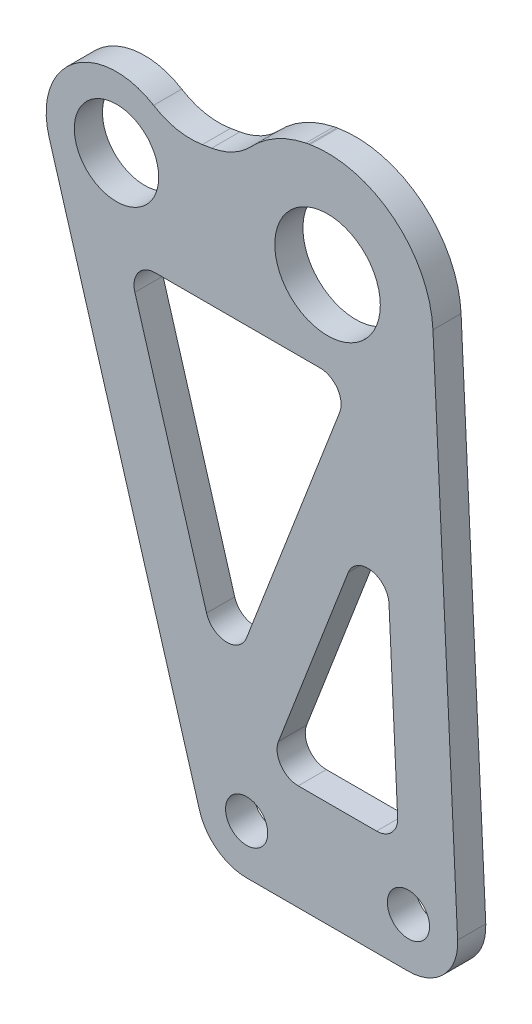
ISO-10303-21;
HEADER;
FILE_DESCRIPTION(('STEP AP214'),'2;1');
FILE_NAME('part.step','',(''),(''),'','','');
FILE_SCHEMA(('AUTOMOTIVE_DESIGN { 1 0 10303 214 1 1 1 1 }'));
ENDSEC;
DATA;
#1=APPLICATION_CONTEXT('core data for automotive mechanical design processes');
#2=APPLICATION_PROTOCOL_DEFINITION('international standard','automotive_design',2000,#1);
#3=PRODUCT_CONTEXT('',#1,'mechanical');
#4=PRODUCT('Part','Part','',(#3));
#5=PRODUCT_RELATED_PRODUCT_CATEGORY('part','',(#4));
#6=PRODUCT_DEFINITION_FORMATION('','',#4);
#7=PRODUCT_DEFINITION_CONTEXT('part definition',#1,'design');
#8=PRODUCT_DEFINITION('design','',#6,#7);
#9=PRODUCT_DEFINITION_SHAPE('','',#8);
#10=(LENGTH_UNIT() NAMED_UNIT(*) SI_UNIT(.MILLI.,.METRE.));
#11=(NAMED_UNIT(*) PLANE_ANGLE_UNIT() SI_UNIT($,.RADIAN.));
#12=(NAMED_UNIT(*) SI_UNIT($,.STERADIAN.) SOLID_ANGLE_UNIT());
#13=UNCERTAINTY_MEASURE_WITH_UNIT(LENGTH_MEASURE(1.E-05),#10,'distance_accuracy_value','');
#14=(GEOMETRIC_REPRESENTATION_CONTEXT(3) GLOBAL_UNCERTAINTY_ASSIGNED_CONTEXT((#13)) GLOBAL_UNIT_ASSIGNED_CONTEXT((#10,
#11,#12)) REPRESENTATION_CONTEXT('',''));
#15=CARTESIAN_POINT('',(0.,0.,0.));
#16=DIRECTION('',(0.,0.,1.));
#17=DIRECTION('',(1.,0.,0.));
#18=AXIS2_PLACEMENT_3D('',#15,#16,#17);
#19=CARTESIAN_POINT('',(-11.5,0.,4.));
#20=DIRECTION('',(0.,0.,1.));
#21=DIRECTION('',(1.,0.,0.));
#22=AXIS2_PLACEMENT_3D('',#19,#20,#21);
#23=PLANE('',#22);
#24=DIRECTION('',(-0.986013297183269,-0.166666666666668,0.));
#25=VECTOR('',#24,1.);
#26=CARTESIAN_POINT('',(-31.6666666666667,82.8601329718327,4.));
#27=LINE('',#26,#25);
#28=CARTESIAN_POINT('',(-2.50000000000001,87.790199457749,4.));
#29=VERTEX_POINT('',#28);
#30=CARTESIAN_POINT('',(-2.69219041403478,87.7577133485212,4.));
#31=VERTEX_POINT('',#30);
#32=EDGE_CURVE('E358',#29,#31,#27,.T.);
#33=ORIENTED_EDGE('',*,*,#32,.T.);
#34=CARTESIAN_POINT('',(-1.02552374736811,77.8975803766885,4.));
#35=DIRECTION('',(0.,0.,1.));
#36=DIRECTION('',(1.,0.,0.));
#37=AXIS2_PLACEMENT_3D('',#34,#35,#36);
#38=CIRCLE('',#37,10.);
#39=CARTESIAN_POINT('',(-3.07501452764109,87.6853067491192,4.));
#40=VERTEX_POINT('',#39);
#41=EDGE_CURVE('E332',#31,#40,#38,.T.);
#42=ORIENTED_EDGE('',*,*,#41,.T.);
#43=CARTESIAN_POINT('',(0.,73.,4.));
#44=DIRECTION('',(0.,0.,-1.));
#45=DIRECTION('',(1.,0.,0.));
#46=AXIS2_PLACEMENT_3D('',#43,#44,#45);
#47=CIRCLE('',#46,15.0037978079195);
#48=CARTESIAN_POINT('',(-10.8789653453183,83.3325728488258,4.));
#49=VERTEX_POINT('',#48);
#50=EDGE_CURVE('E370',#49,#40,#47,.T.);
#51=ORIENTED_EDGE('',*,*,#50,.F.);
#52=CARTESIAN_POINT('',(-18.1297730971903,90.2192111394138,4.));
#53=DIRECTION('',(0.,0.,1.));
#54=DIRECTION('',(1.,0.,0.));
#55=AXIS2_PLACEMENT_3D('',#52,#53,#54);
#56=CIRCLE('',#55,10.);
#57=CARTESIAN_POINT('',(-16.4631064305237,80.3590781675811,4.));
#58=VERTEX_POINT('',#57);
#59=EDGE_CURVE('E346',#49,#58,#56,.F.);
#60=ORIENTED_EDGE('',*,*,#59,.T.);
#61=DIRECTION('',(0.986013297183269,0.166666666666667,0.));
#62=VECTOR('',#61,1.);
#63=CARTESIAN_POINT('',(-22.2942076950337,79.3734421588904,4.));
#64=LINE('',#63,#62);
#65=CARTESIAN_POINT('',(-17.7896034645846,80.1348592451368,4.));
#66=VERTEX_POINT('',#65);
#67=EDGE_CURVE('E352',#66,#58,#64,.T.);
#68=ORIENTED_EDGE('',*,*,#67,.F.);
#69=CARTESIAN_POINT('',(-19.4562701312513,89.9949922169695,4.));
#70=DIRECTION('',(0.,0.,1.));
#71=DIRECTION('',(1.,0.,0.));
#72=AXIS2_PLACEMENT_3D('',#69,#70,#71);
#73=CIRCLE('',#72,10.);
#74=CARTESIAN_POINT('',(-24.7281350656256,81.4974961084848,4.));
#75=VERTEX_POINT('',#74);
#76=EDGE_CURVE('E63',#66,#75,#73,.F.);
#77=ORIENTED_EDGE('',*,*,#76,.T.);
#78=CARTESIAN_POINT('',(-30.,73.,4.));
#79=DIRECTION('',(0.,0.,1.));
#80=DIRECTION('',(1.,0.,0.));
#81=AXIS2_PLACEMENT_3D('',#78,#79,#80);
#82=CIRCLE('',#81,10.);
#83=CARTESIAN_POINT('',(-39.5880069117665,70.15920372784,4.));
#84=VERTEX_POINT('',#83);
#85=EDGE_CURVE('E350',#75,#84,#82,.T.);
#86=ORIENTED_EDGE('',*,*,#85,.T.);
#87=DIRECTION('',(0.284079627216,-0.958800691176648,0.));
#88=VECTOR('',#87,1.);
#89=CARTESIAN_POINT('',(-39.5880069117665,70.15920372784,4.));
#90=LINE('',#89,#88);
#91=CARTESIAN_POINT('',(-18.2116048382365,-1.988557390512,4.));
#92=VERTEX_POINT('',#91);
#93=EDGE_CURVE('E241',#84,#92,#90,.T.);
#94=ORIENTED_EDGE('',*,*,#93,.T.);
#95=CARTESIAN_POINT('',(-11.5,0.,4.));
#96=DIRECTION('',(0.,0.,1.));
#97=DIRECTION('',(1.,0.,0.));
#98=AXIS2_PLACEMENT_3D('',#95,#96,#97);
#99=CIRCLE('',#98,7.);
#100=CARTESIAN_POINT('',(-11.5,-7.,4.));
#101=VERTEX_POINT('',#100);
#102=EDGE_CURVE('E235',#92,#101,#99,.T.);
#103=ORIENTED_EDGE('',*,*,#102,.T.);
#104=DIRECTION('',(1.,0.,0.));
#105=VECTOR('',#104,1.);
#106=CARTESIAN_POINT('',(-11.5,-7.,4.));
#107=LINE('',#106,#105);
#108=CARTESIAN_POINT('',(11.5,-7.,4.));
#109=VERTEX_POINT('',#108);
#110=EDGE_CURVE('E224',#101,#109,#107,.T.);
#111=ORIENTED_EDGE('',*,*,#110,.T.);
#112=CARTESIAN_POINT('',(11.5,0.,4.));
#113=DIRECTION('',(0.,0.,1.));
#114=DIRECTION('',(1.,0.,0.));
#115=AXIS2_PLACEMENT_3D('',#112,#113,#114);
#116=CIRCLE('',#115,7.);
#117=CARTESIAN_POINT('',(18.4920100753608,0.334357751597923,4.));
#118=VERTEX_POINT('',#117);
#119=EDGE_CURVE('E234',#109,#118,#116,.T.);
#120=ORIENTED_EDGE('',*,*,#119,.T.);
#121=DIRECTION('',(-0.0477653930854182,0.998858582194394,0.));
#122=VECTOR('',#121,1.);
#123=CARTESIAN_POINT('',(14.9828787329159,73.7164808962813,4.));
#124=LINE('',#123,#122);
#125=CARTESIAN_POINT('',(14.9828787329159,73.7164808962813,4.));
#126=VERTEX_POINT('',#125);
#127=EDGE_CURVE('E410',#118,#126,#124,.T.);
#128=ORIENTED_EDGE('',*,*,#127,.T.);
#129=CARTESIAN_POINT('',(0.,73.,4.));
#130=DIRECTION('',(0.,0.,1.));
#131=DIRECTION('',(1.,0.,0.));
#132=AXIS2_PLACEMENT_3D('',#129,#130,#131);
#133=CIRCLE('',#132,15.);
#134=EDGE_CURVE('E412',#126,#29,#133,.T.);
#135=ORIENTED_EDGE('',*,*,#134,.T.);
#136=EDGE_LOOP('',(#33,#42,#51,#60,#68,#77,#86,#94,#103,#111,#120,#128,#135));
#137=FACE_BOUND('',#136,.T.);
#138=CARTESIAN_POINT('',(0.,73.,4.));
#139=DIRECTION('',(0.,0.,1.));
#140=DIRECTION('',(1.,0.,0.));
#141=AXIS2_PLACEMENT_3D('',#138,#139,#140);
#142=CIRCLE('',#141,7.5);
#143=CARTESIAN_POINT('',(7.5,73.,4.));
#144=VERTEX_POINT('',#143);
#145=EDGE_CURVE('E392',#144,#144,#142,.T.);
#146=ORIENTED_EDGE('',*,*,#145,.F.);
#147=EDGE_LOOP('',(#146));
#148=FACE_BOUND('',#147,.T.);
#149=CARTESIAN_POINT('',(-11.5,0.,4.));
#150=DIRECTION('',(0.,0.,1.));
#151=DIRECTION('',(1.,0.,0.));
#152=AXIS2_PLACEMENT_3D('',#149,#150,#151);
#153=CIRCLE('',#152,3.);
#154=CARTESIAN_POINT('',(-8.5,0.,4.));
#155=VERTEX_POINT('',#154);
#156=EDGE_CURVE('E404',#155,#155,#153,.T.);
#157=ORIENTED_EDGE('',*,*,#156,.F.);
#158=EDGE_LOOP('',(#157));
#159=FACE_BOUND('',#158,.T.);
#160=CARTESIAN_POINT('',(11.5,0.,4.));
#161=DIRECTION('',(0.,0.,1.));
#162=DIRECTION('',(1.,0.,0.));
#163=AXIS2_PLACEMENT_3D('',#160,#161,#162);
#164=CIRCLE('',#163,3.);
#165=CARTESIAN_POINT('',(14.5,0.,4.));
#166=VERTEX_POINT('',#165);
#167=EDGE_CURVE('E398',#166,#166,#164,.T.);
#168=ORIENTED_EDGE('',*,*,#167,.F.);
#169=EDGE_LOOP('',(#168));
#170=FACE_BOUND('',#169,.T.);
#171=CARTESIAN_POINT('',(-30.,73.,4.));
#172=DIRECTION('',(0.,0.,1.));
#173=DIRECTION('',(1.,0.,0.));
#174=AXIS2_PLACEMENT_3D('',#171,#172,#173);
#175=CIRCLE('',#174,6.);
#176=CARTESIAN_POINT('',(-24.,73.,4.));
#177=VERTEX_POINT('',#176);
#178=EDGE_CURVE('E385',#177,#177,#175,.T.);
#179=ORIENTED_EDGE('',*,*,#178,.F.);
#180=EDGE_LOOP('',(#179));
#181=FACE_BOUND('',#180,.T.);
#182=DIRECTION('',(-0.284079627216,0.958800691176648,0.));
#183=VECTOR('',#182,1.);
#184=CARTESIAN_POINT('',(-9.61313511093276,-2.84824141640891,4.));
#185=LINE('',#184,#183);
#186=CARTESIAN_POINT('',(-17.1971796266505,22.7487617719107,4.));
#187=VERTEX_POINT('',#186);
#188=CARTESIAN_POINT('',(-27.3891360998442,57.147761118352,4.));
#189=VERTEX_POINT('',#188);
#190=EDGE_CURVE('E777',#187,#189,#185,.T.);
#191=ORIENTED_EDGE('',*,*,#190,.T.);
#192=CARTESIAN_POINT('',(-24.5127340263143,58.,4.));
#193=DIRECTION('',(0.,0.,1.));
#194=DIRECTION('',(1.,0.,0.));
#195=AXIS2_PLACEMENT_3D('',#192,#193,#194);
#196=CIRCLE('',#195,3.);
#197=CARTESIAN_POINT('',(-24.5127340263143,61.,4.));
#198=VERTEX_POINT('',#197);
#199=EDGE_CURVE('E317',#189,#198,#196,.F.);
#200=ORIENTED_EDGE('',*,*,#199,.T.);
#201=DIRECTION('',(1.,0.,0.));
#202=VECTOR('',#201,1.);
#203=CARTESIAN_POINT('',(0.,61.,4.));
#204=LINE('',#203,#202);
#205=CARTESIAN_POINT('',(-1.07446247065,61.,4.));
#206=VERTEX_POINT('',#205);
#207=EDGE_CURVE('E774',#198,#206,#204,.T.);
#208=ORIENTED_EDGE('',*,*,#207,.T.);
#209=CARTESIAN_POINT('',(-1.07446247065,58.,4.));
#210=DIRECTION('',(0.,0.,1.));
#211=DIRECTION('',(1.,0.,0.));
#212=AXIS2_PLACEMENT_3D('',#209,#210,#211);
#213=CIRCLE('',#212,3.);
#214=CARTESIAN_POINT('',(1.72513971247356,56.9219333896972,4.));
#215=VERTEX_POINT('',#214);
#216=EDGE_CURVE('E321',#206,#215,#213,.F.);
#217=ORIENTED_EDGE('',*,*,#216,.T.);
#218=DIRECTION('',(-0.359355536767607,-0.933200727707852,0.));
#219=VECTOR('',#218,1.);
#220=CARTESIAN_POINT('',(-17.5864572783995,6.77216659554331,4.));
#221=LINE('',#220,#219);
#222=CARTESIAN_POINT('',(-11.5211753699969,22.5229340432559,4.));
#223=VERTEX_POINT('',#222);
#224=EDGE_CURVE('E768',#215,#223,#221,.T.);
#225=ORIENTED_EDGE('',*,*,#224,.T.);
#226=CARTESIAN_POINT('',(-14.3207775531205,23.6010006535587,4.));
#227=DIRECTION('',(0.,0.,1.));
#228=DIRECTION('',(1.,0.,0.));
#229=AXIS2_PLACEMENT_3D('',#226,#227,#228);
#230=CIRCLE('',#229,3.);
#231=EDGE_CURVE('E313',#223,#187,#230,.F.);
#232=ORIENTED_EDGE('',*,*,#231,.T.);
#233=EDGE_LOOP('',(#191,#200,#208,#217,#225,#232));
#234=FACE_BOUND('',#233,.T.);
#235=DIRECTION('',(-0.359355536767607,-0.933200727707852,0.));
#236=VECTOR('',#235,1.);
#237=CARTESIAN_POINT('',(-10.1208514567366,3.89732230140245,4.));
#238=LINE('',#237,#236);
#239=CARTESIAN_POINT('',(2.93918358285541,37.8125760149386,4.));
#240=VERTEX_POINT('',#239);
#241=CARTESIAN_POINT('',(-6.97062270637526,12.0780666103028,4.));
#242=VERTEX_POINT('',#241);
#243=EDGE_CURVE('E765',#240,#242,#238,.T.);
#244=ORIENTED_EDGE('',*,*,#243,.F.);
#245=CARTESIAN_POINT('',(5.73878576597896,36.7345094046358,4.));
#246=DIRECTION('',(0.,0.,1.));
#247=DIRECTION('',(1.,0.,0.));
#248=AXIS2_PLACEMENT_3D('',#245,#246,#247);
#249=CIRCLE('',#248,3.);
#250=CARTESIAN_POINT('',(8.73536151256215,36.877805583892,4.));
#251=VERTEX_POINT('',#250);
#252=EDGE_CURVE('E309',#240,#251,#249,.F.);
#253=ORIENTED_EDGE('',*,*,#252,.T.);
#254=DIRECTION('',(0.0477653930854184,-0.998858582194394,0.));
#255=VECTOR('',#254,1.);
#256=CARTESIAN_POINT('',(10.4749037908747,0.50090964429006,4.));
#257=LINE('',#256,#255);
#258=CARTESIAN_POINT('',(9.96598512583916,11.1432961792563,4.));
#259=VERTEX_POINT('',#258);
#260=EDGE_CURVE('E761',#251,#259,#257,.T.);
#261=ORIENTED_EDGE('',*,*,#260,.T.);
#262=CARTESIAN_POINT('',(6.96940937925598,11.,4.));
#263=DIRECTION('',(0.,0.,1.));
#264=DIRECTION('',(1.,0.,0.));
#265=AXIS2_PLACEMENT_3D('',#262,#263,#264);
#266=CIRCLE('',#265,3.);
#267=CARTESIAN_POINT('',(6.96940937925598,8.,4.));
#268=VERTEX_POINT('',#267);
#269=EDGE_CURVE('E305',#259,#268,#266,.F.);
#270=ORIENTED_EDGE('',*,*,#269,.T.);
#271=DIRECTION('',(-1.,0.,0.));
#272=VECTOR('',#271,1.);
#273=CARTESIAN_POINT('',(0.,8.,4.));
#274=LINE('',#273,#272);
#275=CARTESIAN_POINT('',(-4.17102052325171,8.,4.));
#276=VERTEX_POINT('',#275);
#277=EDGE_CURVE('E755',#268,#276,#274,.T.);
#278=ORIENTED_EDGE('',*,*,#277,.T.);
#279=CARTESIAN_POINT('',(-4.17102052325171,11.,4.));
#280=DIRECTION('',(0.,0.,1.));
#281=DIRECTION('',(1.,0.,0.));
#282=AXIS2_PLACEMENT_3D('',#279,#280,#281);
#283=CIRCLE('',#282,3.);
#284=EDGE_CURVE('E325',#276,#242,#283,.F.);
#285=ORIENTED_EDGE('',*,*,#284,.T.);
#286=EDGE_LOOP('',(#244,#253,#261,#270,#278,#285));
#287=FACE_BOUND('',#286,.T.);
#288=ADVANCED_FACE('F55',(#137,#148,#159,#170,#181,#234,#287),#23,.T.);
#289=CARTESIAN_POINT('',(-11.5,0.,0.));
#290=DIRECTION('',(0.,0.,1.));
#291=DIRECTION('',(1.,0.,0.));
#292=AXIS2_PLACEMENT_3D('',#289,#290,#291);
#293=PLANE('',#292);
#294=DIRECTION('',(-0.359355536767607,-0.933200727707852,0.));
#295=VECTOR('',#294,1.);
#296=CARTESIAN_POINT('',(-19.0715258991631,2.91563183874348,0.));
#297=LINE('',#296,#295);
#298=CARTESIAN_POINT('',(1.72513971247356,56.9219333896972,0.));
#299=VERTEX_POINT('',#298);
#300=CARTESIAN_POINT('',(-11.521175369997,22.5229340432558,0.));
#301=VERTEX_POINT('',#300);
#302=EDGE_CURVE('E263',#299,#301,#297,.T.);
#303=ORIENTED_EDGE('',*,*,#302,.F.);
#304=CARTESIAN_POINT('',(-1.07446247065,58.,0.));
#305=DIRECTION('',(0.,0.,1.));
#306=DIRECTION('',(1.,0.,0.));
#307=AXIS2_PLACEMENT_3D('',#304,#305,#306);
#308=CIRCLE('',#307,3.);
#309=CARTESIAN_POINT('',(-1.07446247065,61.,0.));
#310=VERTEX_POINT('',#309);
#311=EDGE_CURVE('E323',#299,#310,#308,.T.);
#312=ORIENTED_EDGE('',*,*,#311,.T.);
#313=DIRECTION('',(1.,0.,0.));
#314=VECTOR('',#313,1.);
#315=CARTESIAN_POINT('',(-11.5,61.,0.));
#316=LINE('',#315,#314);
#317=CARTESIAN_POINT('',(-24.5127340263143,61.,0.));
#318=VERTEX_POINT('',#317);
#319=EDGE_CURVE('E252',#318,#310,#316,.T.);
#320=ORIENTED_EDGE('',*,*,#319,.F.);
#321=CARTESIAN_POINT('',(-24.5127340263143,58.,0.));
#322=DIRECTION('',(0.,0.,1.));
#323=DIRECTION('',(1.,0.,0.));
#324=AXIS2_PLACEMENT_3D('',#321,#322,#323);
#325=CIRCLE('',#324,3.);
#326=CARTESIAN_POINT('',(-27.3891360998442,57.147761118352,0.));
#327=VERTEX_POINT('',#326);
#328=EDGE_CURVE('E319',#318,#327,#325,.T.);
#329=ORIENTED_EDGE('',*,*,#328,.T.);
#330=DIRECTION('',(-0.284079627216,0.958800691176648,0.));
#331=VECTOR('',#330,1.);
#332=CARTESIAN_POINT('',(-10.5411993088233,0.284079627216001,0.));
#333=LINE('',#332,#331);
#334=CARTESIAN_POINT('',(-17.1971796266505,22.7487617719107,0.));
#335=VERTEX_POINT('',#334);
#336=EDGE_CURVE('E260',#335,#327,#333,.T.);
#337=ORIENTED_EDGE('',*,*,#336,.F.);
#338=CARTESIAN_POINT('',(-14.3207775531205,23.6010006535587,0.));
#339=DIRECTION('',(0.,0.,1.));
#340=DIRECTION('',(1.,0.,0.));
#341=AXIS2_PLACEMENT_3D('',#338,#339,#340);
#342=CIRCLE('',#341,3.);
#343=EDGE_CURVE('E315',#335,#301,#342,.T.);
#344=ORIENTED_EDGE('',*,*,#343,.T.);
#345=EDGE_LOOP('',(#303,#312,#320,#329,#337,#344));
#346=FACE_BOUND('',#345,.T.);
#347=CARTESIAN_POINT('',(0.,73.,0.));
#348=DIRECTION('',(0.,0.,1.));
#349=DIRECTION('',(1.,0.,0.));
#350=AXIS2_PLACEMENT_3D('',#347,#348,#349);
#351=CIRCLE('',#350,15.0037978079195);
#352=CARTESIAN_POINT('',(-10.8789653453183,83.3325728488258,0.));
#353=VERTEX_POINT('',#352);
#354=CARTESIAN_POINT('',(-3.07501452764109,87.6853067491192,0.));
#355=VERTEX_POINT('',#354);
#356=EDGE_CURVE('E369',#353,#355,#351,.F.);
#357=ORIENTED_EDGE('',*,*,#356,.T.);
#358=CARTESIAN_POINT('',(-1.02552374736811,77.8975803766885,0.));
#359=DIRECTION('',(0.,0.,1.));
#360=DIRECTION('',(1.,0.,0.));
#361=AXIS2_PLACEMENT_3D('',#358,#359,#360);
#362=CIRCLE('',#361,10.);
#363=CARTESIAN_POINT('',(-2.69219041403478,87.7577133485212,0.));
#364=VERTEX_POINT('',#363);
#365=EDGE_CURVE('E339',#355,#364,#362,.F.);
#366=ORIENTED_EDGE('',*,*,#365,.T.);
#367=DIRECTION('',(-0.986013297183269,-0.166666666666668,0.));
#368=VECTOR('',#367,1.);
#369=CARTESIAN_POINT('',(-31.6666666666667,82.8601329718327,0.));
#370=LINE('',#369,#368);
#371=CARTESIAN_POINT('',(-2.50000000000001,87.790199457749,0.));
#372=VERTEX_POINT('',#371);
#373=EDGE_CURVE('E426',#372,#364,#370,.T.);
#374=ORIENTED_EDGE('',*,*,#373,.F.);
#375=CARTESIAN_POINT('',(0.,73.,0.));
#376=DIRECTION('',(0.,0.,1.));
#377=DIRECTION('',(1.,0.,0.));
#378=AXIS2_PLACEMENT_3D('',#375,#376,#377);
#379=CIRCLE('',#378,15.);
#380=CARTESIAN_POINT('',(14.9828787329159,73.7164808962813,0.));
#381=VERTEX_POINT('',#380);
#382=EDGE_CURVE('E424',#381,#372,#379,.T.);
#383=ORIENTED_EDGE('',*,*,#382,.F.);
#384=DIRECTION('',(-0.0477653930854182,0.998858582194394,0.));
#385=VECTOR('',#384,1.);
#386=CARTESIAN_POINT('',(14.9828787329159,73.7164808962813,0.));
#387=LINE('',#386,#385);
#388=CARTESIAN_POINT('',(18.4920100753608,0.334357751597923,0.));
#389=VERTEX_POINT('',#388);
#390=EDGE_CURVE('E422',#389,#381,#387,.T.);
#391=ORIENTED_EDGE('',*,*,#390,.F.);
#392=CARTESIAN_POINT('',(11.5,0.,0.));
#393=DIRECTION('',(0.,0.,1.));
#394=DIRECTION('',(1.,0.,0.));
#395=AXIS2_PLACEMENT_3D('',#392,#393,#394);
#396=CIRCLE('',#395,7.);
#397=CARTESIAN_POINT('',(11.5,-7.,0.));
#398=VERTEX_POINT('',#397);
#399=EDGE_CURVE('E420',#398,#389,#396,.T.);
#400=ORIENTED_EDGE('',*,*,#399,.F.);
#401=DIRECTION('',(1.,0.,0.));
#402=VECTOR('',#401,1.);
#403=CARTESIAN_POINT('',(-11.5,-7.,0.));
#404=LINE('',#403,#402);
#405=CARTESIAN_POINT('',(-11.5,-7.,0.));
#406=VERTEX_POINT('',#405);
#407=EDGE_CURVE('E418',#406,#398,#404,.T.);
#408=ORIENTED_EDGE('',*,*,#407,.F.);
#409=CARTESIAN_POINT('',(-11.5,0.,0.));
#410=DIRECTION('',(0.,0.,1.));
#411=DIRECTION('',(1.,0.,0.));
#412=AXIS2_PLACEMENT_3D('',#409,#410,#411);
#413=CIRCLE('',#412,7.);
#414=CARTESIAN_POINT('',(-18.2116048382365,-1.988557390512,0.));
#415=VERTEX_POINT('',#414);
#416=EDGE_CURVE('E249',#415,#406,#413,.T.);
#417=ORIENTED_EDGE('',*,*,#416,.F.);
#418=DIRECTION('',(0.284079627216,-0.958800691176648,0.));
#419=VECTOR('',#418,1.);
#420=CARTESIAN_POINT('',(-39.5880069117665,70.15920372784,0.));
#421=LINE('',#420,#419);
#422=CARTESIAN_POINT('',(-39.5880069117665,70.15920372784,0.));
#423=VERTEX_POINT('',#422);
#424=EDGE_CURVE('E245',#423,#415,#421,.T.);
#425=ORIENTED_EDGE('',*,*,#424,.F.);
#426=CARTESIAN_POINT('',(-30.,73.,0.));
#427=DIRECTION('',(0.,0.,1.));
#428=DIRECTION('',(1.,0.,0.));
#429=AXIS2_PLACEMENT_3D('',#426,#427,#428);
#430=CIRCLE('',#429,10.);
#431=CARTESIAN_POINT('',(-24.7281350656256,81.4974961084848,0.));
#432=VERTEX_POINT('',#431);
#433=EDGE_CURVE('E367',#432,#423,#430,.T.);
#434=ORIENTED_EDGE('',*,*,#433,.F.);
#435=CARTESIAN_POINT('',(-19.4562701312513,89.9949922169695,0.));
#436=DIRECTION('',(0.,0.,1.));
#437=DIRECTION('',(1.,0.,0.));
#438=AXIS2_PLACEMENT_3D('',#435,#436,#437);
#439=CIRCLE('',#438,10.);
#440=CARTESIAN_POINT('',(-17.7896034645846,80.1348592451368,0.));
#441=VERTEX_POINT('',#440);
#442=EDGE_CURVE('E12',#432,#441,#439,.T.);
#443=ORIENTED_EDGE('',*,*,#442,.T.);
#444=DIRECTION('',(0.986013297183269,0.166666666666667,0.));
#445=VECTOR('',#444,1.);
#446=CARTESIAN_POINT('',(-24.8437173379521,78.9424963744537,0.));
#447=LINE('',#446,#445);
#448=CARTESIAN_POINT('',(-16.4631064305237,80.3590781675811,0.));
#449=VERTEX_POINT('',#448);
#450=EDGE_CURVE('E250',#441,#449,#447,.T.);
#451=ORIENTED_EDGE('',*,*,#450,.T.);
#452=CARTESIAN_POINT('',(-18.1297730971903,90.2192111394138,0.));
#453=DIRECTION('',(0.,0.,1.));
#454=DIRECTION('',(1.,0.,0.));
#455=AXIS2_PLACEMENT_3D('',#452,#453,#454);
#456=CIRCLE('',#455,10.);
#457=EDGE_CURVE('E348',#449,#353,#456,.T.);
#458=ORIENTED_EDGE('',*,*,#457,.T.);
#459=EDGE_LOOP('',(#357,#366,#374,#383,#391,#400,#408,#417,#425,#434,#443,#451,#458));
#460=FACE_BOUND('',#459,.T.);
#461=CARTESIAN_POINT('',(-11.5,0.,0.));
#462=DIRECTION('',(0.,0.,1.));
#463=DIRECTION('',(1.,0.,0.));
#464=AXIS2_PLACEMENT_3D('',#461,#462,#463);
#465=CIRCLE('',#464,3.);
#466=CARTESIAN_POINT('',(-8.5,0.,0.));
#467=VERTEX_POINT('',#466);
#468=EDGE_CURVE('E401',#467,#467,#465,.T.);
#469=ORIENTED_EDGE('',*,*,#468,.T.);
#470=EDGE_LOOP('',(#469));
#471=FACE_BOUND('',#470,.T.);
#472=CARTESIAN_POINT('',(11.5,0.,0.));
#473=DIRECTION('',(0.,0.,1.));
#474=DIRECTION('',(1.,0.,0.));
#475=AXIS2_PLACEMENT_3D('',#472,#473,#474);
#476=CIRCLE('',#475,3.);
#477=CARTESIAN_POINT('',(14.5,0.,0.));
#478=VERTEX_POINT('',#477);
#479=EDGE_CURVE('E395',#478,#478,#476,.T.);
#480=ORIENTED_EDGE('',*,*,#479,.T.);
#481=EDGE_LOOP('',(#480));
#482=FACE_BOUND('',#481,.T.);
#483=CARTESIAN_POINT('',(0.,73.,0.));
#484=DIRECTION('',(0.,0.,1.));
#485=DIRECTION('',(1.,0.,0.));
#486=AXIS2_PLACEMENT_3D('',#483,#484,#485);
#487=CIRCLE('',#486,7.5);
#488=CARTESIAN_POINT('',(7.5,73.,0.));
#489=VERTEX_POINT('',#488);
#490=EDGE_CURVE('E390',#489,#489,#487,.T.);
#491=ORIENTED_EDGE('',*,*,#490,.T.);
#492=EDGE_LOOP('',(#491));
#493=FACE_BOUND('',#492,.T.);
#494=CARTESIAN_POINT('',(-30.,73.,0.));
#495=DIRECTION('',(0.,0.,1.));
#496=DIRECTION('',(1.,0.,0.));
#497=AXIS2_PLACEMENT_3D('',#494,#495,#496);
#498=CIRCLE('',#497,6.);
#499=CARTESIAN_POINT('',(-24.,73.,0.));
#500=VERTEX_POINT('',#499);
#501=EDGE_CURVE('E382',#500,#500,#498,.T.);
#502=ORIENTED_EDGE('',*,*,#501,.T.);
#503=EDGE_LOOP('',(#502));
#504=FACE_BOUND('',#503,.T.);
#505=DIRECTION('',(0.0477653930854184,-0.998858582194394,0.));
#506=VECTOR('',#505,1.);
#507=CARTESIAN_POINT('',(10.4486661639437,1.04958468166554,0.));
#508=LINE('',#507,#506);
#509=CARTESIAN_POINT('',(8.73536151256215,36.877805583892,0.));
#510=VERTEX_POINT('',#509);
#511=CARTESIAN_POINT('',(9.96598512583917,11.1432961792563,0.));
#512=VERTEX_POINT('',#511);
#513=EDGE_CURVE('E272',#510,#512,#508,.T.);
#514=ORIENTED_EDGE('',*,*,#513,.F.);
#515=CARTESIAN_POINT('',(5.73878576597896,36.7345094046358,0.));
#516=DIRECTION('',(0.,0.,1.));
#517=DIRECTION('',(1.,0.,0.));
#518=AXIS2_PLACEMENT_3D('',#515,#516,#517);
#519=CIRCLE('',#518,3.);
#520=CARTESIAN_POINT('',(2.93918358285541,37.8125760149386,0.));
#521=VERTEX_POINT('',#520);
#522=EDGE_CURVE('E311',#510,#521,#519,.T.);
#523=ORIENTED_EDGE('',*,*,#522,.T.);
#524=DIRECTION('',(-0.359355536767607,-0.933200727707852,0.));
#525=VECTOR('',#524,1.);
#526=CARTESIAN_POINT('',(-11.6059200775003,0.040787544602623,0.));
#527=LINE('',#526,#525);
#528=CARTESIAN_POINT('',(-6.97062270637526,12.0780666103028,0.));
#529=VERTEX_POINT('',#528);
#530=EDGE_CURVE('E266',#521,#529,#527,.T.);
#531=ORIENTED_EDGE('',*,*,#530,.T.);
#532=CARTESIAN_POINT('',(-4.17102052325171,11.,0.));
#533=DIRECTION('',(0.,0.,1.));
#534=DIRECTION('',(1.,0.,0.));
#535=AXIS2_PLACEMENT_3D('',#532,#533,#534);
#536=CIRCLE('',#535,3.);
#537=CARTESIAN_POINT('',(-4.17102052325171,8.,0.));
#538=VERTEX_POINT('',#537);
#539=EDGE_CURVE('E327',#529,#538,#536,.T.);
#540=ORIENTED_EDGE('',*,*,#539,.T.);
#541=DIRECTION('',(-1.,0.,0.));
#542=VECTOR('',#541,1.);
#543=CARTESIAN_POINT('',(-11.5,8.,0.));
#544=LINE('',#543,#542);
#545=CARTESIAN_POINT('',(6.96940937925598,8.,0.));
#546=VERTEX_POINT('',#545);
#547=EDGE_CURVE('E269',#546,#538,#544,.T.);
#548=ORIENTED_EDGE('',*,*,#547,.F.);
#549=CARTESIAN_POINT('',(6.96940937925598,11.,0.));
#550=DIRECTION('',(0.,0.,1.));
#551=DIRECTION('',(1.,0.,0.));
#552=AXIS2_PLACEMENT_3D('',#549,#550,#551);
#553=CIRCLE('',#552,3.);
#554=EDGE_CURVE('E307',#546,#512,#553,.T.);
#555=ORIENTED_EDGE('',*,*,#554,.T.);
#556=EDGE_LOOP('',(#514,#523,#531,#540,#548,#555));
#557=FACE_BOUND('',#556,.T.);
#558=ADVANCED_FACE('F363',(#346,#460,#471,#482,#493,#504,#557),#293,.F.);
#559=CARTESIAN_POINT('',(-11.5,0.,4.));
#560=DIRECTION('',(0.,0.,-1.));
#561=DIRECTION('',(-1.,0.,0.));
#562=AXIS2_PLACEMENT_3D('',#559,#560,#561);
#563=CYLINDRICAL_SURFACE('',#562,7.);
#564=ORIENTED_EDGE('',*,*,#416,.T.);
#565=DIRECTION('',(0.,0.,-1.));
#566=VECTOR('',#565,1.);
#567=CARTESIAN_POINT('',(-11.5,-7.,4.));
#568=LINE('',#567,#566);
#569=EDGE_CURVE('E228',#101,#406,#568,.T.);
#570=ORIENTED_EDGE('',*,*,#569,.F.);
#571=ORIENTED_EDGE('',*,*,#102,.F.);
#572=DIRECTION('',(0.,0.,-1.));
#573=VECTOR('',#572,1.);
#574=CARTESIAN_POINT('',(-18.2116048382365,-1.988557390512,4.));
#575=LINE('',#574,#573);
#576=EDGE_CURVE('E416',#92,#415,#575,.T.);
#577=ORIENTED_EDGE('',*,*,#576,.T.);
#578=EDGE_LOOP('',(#564,#570,#571,#577));
#579=FACE_BOUND('',#578,.T.);
#580=ADVANCED_FACE('F247',(#579),#563,.T.);
#581=CARTESIAN_POINT('',(-11.5,-7.,4.));
#582=DIRECTION('',(0.,1.,0.));
#583=DIRECTION('',(-1.,0.,0.));
#584=AXIS2_PLACEMENT_3D('',#581,#582,#583);
#585=PLANE('',#584);
#586=ORIENTED_EDGE('',*,*,#407,.T.);
#587=DIRECTION('',(0.,0.,-1.));
#588=VECTOR('',#587,1.);
#589=CARTESIAN_POINT('',(11.5,-7.,4.));
#590=LINE('',#589,#588);
#591=EDGE_CURVE('E231',#109,#398,#590,.T.);
#592=ORIENTED_EDGE('',*,*,#591,.F.);
#593=ORIENTED_EDGE('',*,*,#110,.F.);
#594=ORIENTED_EDGE('',*,*,#569,.T.);
#595=EDGE_LOOP('',(#586,#592,#593,#594));
#596=FACE_BOUND('',#595,.T.);
#597=ADVANCED_FACE('F226',(#596),#585,.F.);
#598=CARTESIAN_POINT('',(11.5,0.,4.));
#599=DIRECTION('',(0.,0.,-1.));
#600=DIRECTION('',(-1.,0.,0.));
#601=AXIS2_PLACEMENT_3D('',#598,#599,#600);
#602=CYLINDRICAL_SURFACE('',#601,7.);
#603=ORIENTED_EDGE('',*,*,#399,.T.);
#604=DIRECTION('',(0.,0.,-1.));
#605=VECTOR('',#604,1.);
#606=CARTESIAN_POINT('',(18.4920100753608,0.334357751597923,4.));
#607=LINE('',#606,#605);
#608=EDGE_CURVE('E254',#118,#389,#607,.T.);
#609=ORIENTED_EDGE('',*,*,#608,.F.);
#610=ORIENTED_EDGE('',*,*,#119,.F.);
#611=ORIENTED_EDGE('',*,*,#591,.T.);
#612=EDGE_LOOP('',(#603,#609,#610,#611));
#613=FACE_BOUND('',#612,.T.);
#614=ADVANCED_FACE('F457',(#613),#602,.T.);
#615=CARTESIAN_POINT('',(14.9828787329159,73.7164808962813,4.));
#616=DIRECTION('',(-0.998858582194394,-0.0477653930854182,0.));
#617=DIRECTION('',(0.0477653930854182,-0.998858582194394,0.));
#618=AXIS2_PLACEMENT_3D('',#615,#616,#617);
#619=PLANE('',#618);
#620=ORIENTED_EDGE('',*,*,#390,.T.);
#621=DIRECTION('',(0.,0.,-1.));
#622=VECTOR('',#621,1.);
#623=CARTESIAN_POINT('',(14.9828787329159,73.7164808962813,4.));
#624=LINE('',#623,#622);
#625=EDGE_CURVE('E436',#126,#381,#624,.T.);
#626=ORIENTED_EDGE('',*,*,#625,.F.);
#627=ORIENTED_EDGE('',*,*,#127,.F.);
#628=ORIENTED_EDGE('',*,*,#608,.T.);
#629=EDGE_LOOP('',(#620,#626,#627,#628));
#630=FACE_BOUND('',#629,.T.);
#631=ADVANCED_FACE('F443',(#630),#619,.F.);
#632=CARTESIAN_POINT('',(0.,73.,4.));
#633=DIRECTION('',(0.,0.,-1.));
#634=DIRECTION('',(-1.,0.,0.));
#635=AXIS2_PLACEMENT_3D('',#632,#633,#634);
#636=CYLINDRICAL_SURFACE('',#635,15.);
#637=ORIENTED_EDGE('',*,*,#382,.T.);
#638=DIRECTION('',(0.,0.,-1.));
#639=VECTOR('',#638,1.);
#640=CARTESIAN_POINT('',(-2.50000000000001,87.790199457749,4.));
#641=LINE('',#640,#639);
#642=EDGE_CURVE('E433',#29,#372,#641,.T.);
#643=ORIENTED_EDGE('',*,*,#642,.F.);
#644=ORIENTED_EDGE('',*,*,#134,.F.);
#645=ORIENTED_EDGE('',*,*,#625,.T.);
#646=EDGE_LOOP('',(#637,#643,#644,#645));
#647=FACE_BOUND('',#646,.T.);
#648=ADVANCED_FACE('F451',(#647),#636,.T.);
#649=CARTESIAN_POINT('',(-31.6666666666667,82.8601329718327,4.));
#650=DIRECTION('',(0.166666666666668,-0.986013297183269,0.));
#651=DIRECTION('',(0.986013297183269,0.166666666666668,0.));
#652=AXIS2_PLACEMENT_3D('',#649,#650,#651);
#653=PLANE('',#652);
#654=ORIENTED_EDGE('',*,*,#373,.T.);
#655=DIRECTION('',(0.,0.,1.));
#656=VECTOR('',#655,1.);
#657=CARTESIAN_POINT('',(-2.69219041403479,87.7577133485212,4.));
#658=LINE('',#657,#656);
#659=EDGE_CURVE('E329',#364,#31,#658,.T.);
#660=ORIENTED_EDGE('',*,*,#659,.T.);
#661=ORIENTED_EDGE('',*,*,#32,.F.);
#662=ORIENTED_EDGE('',*,*,#642,.T.);
#663=EDGE_LOOP('',(#654,#660,#661,#662));
#664=FACE_BOUND('',#663,.T.);
#665=ADVANCED_FACE('F455',(#664),#653,.F.);
#666=CARTESIAN_POINT('',(-30.,73.,4.));
#667=DIRECTION('',(0.,0.,-1.));
#668=DIRECTION('',(-1.,0.,0.));
#669=AXIS2_PLACEMENT_3D('',#666,#667,#668);
#670=CYLINDRICAL_SURFACE('',#669,10.);
#671=ORIENTED_EDGE('',*,*,#85,.F.);
#672=DIRECTION('',(0.,0.,-1.));
#673=VECTOR('',#672,1.);
#674=CARTESIAN_POINT('',(-24.7281350656256,81.4974961084848,4.));
#675=LINE('',#674,#673);
#676=EDGE_CURVE('E70',#75,#432,#675,.T.);
#677=ORIENTED_EDGE('',*,*,#676,.T.);
#678=ORIENTED_EDGE('',*,*,#433,.T.);
#679=DIRECTION('',(0.,0.,-1.));
#680=VECTOR('',#679,1.);
#681=CARTESIAN_POINT('',(-39.5880069117665,70.15920372784,4.));
#682=LINE('',#681,#680);
#683=EDGE_CURVE('E357',#84,#423,#682,.T.);
#684=ORIENTED_EDGE('',*,*,#683,.F.);
#685=EDGE_LOOP('',(#671,#677,#678,#684));
#686=FACE_BOUND('',#685,.T.);
#687=ADVANCED_FACE('F355',(#686),#670,.T.);
#688=CARTESIAN_POINT('',(-39.5880069117665,70.15920372784,4.));
#689=DIRECTION('',(0.958800691176648,0.284079627216,0.));
#690=DIRECTION('',(-0.284079627216,0.958800691176648,0.));
#691=AXIS2_PLACEMENT_3D('',#688,#689,#690);
#692=PLANE('',#691);
#693=ORIENTED_EDGE('',*,*,#424,.T.);
#694=ORIENTED_EDGE('',*,*,#576,.F.);
#695=ORIENTED_EDGE('',*,*,#93,.F.);
#696=ORIENTED_EDGE('',*,*,#683,.T.);
#697=EDGE_LOOP('',(#693,#694,#695,#696));
#698=FACE_BOUND('',#697,.T.);
#699=ADVANCED_FACE('F477',(#698),#692,.F.);
#700=CARTESIAN_POINT('',(-11.5,0.,4.));
#701=DIRECTION('',(0.,0.,-1.));
#702=DIRECTION('',(-1.,0.,0.));
#703=AXIS2_PLACEMENT_3D('',#700,#701,#702);
#704=CYLINDRICAL_SURFACE('',#703,3.);
#705=ORIENTED_EDGE('',*,*,#156,.T.);
#706=EDGE_LOOP('',(#705));
#707=FACE_BOUND('',#706,.T.);
#708=ORIENTED_EDGE('',*,*,#468,.F.);
#709=EDGE_LOOP('',(#708));
#710=FACE_BOUND('',#709,.T.);
#711=ADVANCED_FACE('F474',(#707,#710),#704,.F.);
#712=CARTESIAN_POINT('',(11.5,0.,4.));
#713=DIRECTION('',(0.,0.,-1.));
#714=DIRECTION('',(-1.,0.,0.));
#715=AXIS2_PLACEMENT_3D('',#712,#713,#714);
#716=CYLINDRICAL_SURFACE('',#715,3.);
#717=ORIENTED_EDGE('',*,*,#167,.T.);
#718=EDGE_LOOP('',(#717));
#719=FACE_BOUND('',#718,.T.);
#720=ORIENTED_EDGE('',*,*,#479,.F.);
#721=EDGE_LOOP('',(#720));
#722=FACE_BOUND('',#721,.T.);
#723=ADVANCED_FACE('F510',(#719,#722),#716,.F.);
#724=CARTESIAN_POINT('',(0.,73.,4.));
#725=DIRECTION('',(0.,0.,-1.));
#726=DIRECTION('',(-1.,0.,0.));
#727=AXIS2_PLACEMENT_3D('',#724,#725,#726);
#728=CYLINDRICAL_SURFACE('',#727,7.5);
#729=ORIENTED_EDGE('',*,*,#145,.T.);
#730=EDGE_LOOP('',(#729));
#731=FACE_BOUND('',#730,.T.);
#732=ORIENTED_EDGE('',*,*,#490,.F.);
#733=EDGE_LOOP('',(#732));
#734=FACE_BOUND('',#733,.T.);
#735=ADVANCED_FACE('F517',(#731,#734),#728,.F.);
#736=CARTESIAN_POINT('',(-30.,73.,4.));
#737=DIRECTION('',(0.,0.,-1.));
#738=DIRECTION('',(-1.,0.,0.));
#739=AXIS2_PLACEMENT_3D('',#736,#737,#738);
#740=CYLINDRICAL_SURFACE('',#739,6.);
#741=ORIENTED_EDGE('',*,*,#178,.T.);
#742=EDGE_LOOP('',(#741));
#743=FACE_BOUND('',#742,.T.);
#744=ORIENTED_EDGE('',*,*,#501,.F.);
#745=EDGE_LOOP('',(#744));
#746=FACE_BOUND('',#745,.T.);
#747=ADVANCED_FACE('F524',(#743,#746),#740,.F.);
#748=CARTESIAN_POINT('',(-22.2942076950337,79.3734421588904,-6.));
#749=DIRECTION('',(0.166666666666667,-0.986013297183269,0.));
#750=DIRECTION('',(0.986013297183269,0.166666666666667,0.));
#751=AXIS2_PLACEMENT_3D('',#748,#749,#750);
#752=PLANE('',#751);
#753=ORIENTED_EDGE('',*,*,#67,.T.);
#754=DIRECTION('',(0.,0.,-1.));
#755=VECTOR('',#754,1.);
#756=CARTESIAN_POINT('',(-16.4631064305237,80.3590781675811,0.));
#757=LINE('',#756,#755);
#758=EDGE_CURVE('E78',#58,#449,#757,.T.);
#759=ORIENTED_EDGE('',*,*,#758,.T.);
#760=ORIENTED_EDGE('',*,*,#450,.F.);
#761=DIRECTION('',(0.,0.,1.));
#762=VECTOR('',#761,1.);
#763=CARTESIAN_POINT('',(-17.7896034645846,80.1348592451368,4.));
#764=LINE('',#763,#762);
#765=EDGE_CURVE('E341',#441,#66,#764,.T.);
#766=ORIENTED_EDGE('',*,*,#765,.T.);
#767=EDGE_LOOP('',(#753,#759,#760,#766));
#768=FACE_BOUND('',#767,.T.);
#769=ADVANCED_FACE('F368',(#768),#752,.F.);
#770=CARTESIAN_POINT('',(0.,73.,-6.));
#771=DIRECTION('',(0.,0.,1.));
#772=DIRECTION('',(1.,0.,0.));
#773=AXIS2_PLACEMENT_3D('',#770,#771,#772);
#774=CYLINDRICAL_SURFACE('',#773,15.0037978079195);
#775=ORIENTED_EDGE('',*,*,#50,.T.);
#776=DIRECTION('',(0.,0.,1.));
#777=VECTOR('',#776,1.);
#778=CARTESIAN_POINT('',(-3.07501452764109,87.6853067491192,-6.));
#779=LINE('',#778,#777);
#780=EDGE_CURVE('E337',#40,#355,#779,.F.);
#781=ORIENTED_EDGE('',*,*,#780,.T.);
#782=ORIENTED_EDGE('',*,*,#356,.F.);
#783=DIRECTION('',(0.,0.,1.));
#784=VECTOR('',#783,1.);
#785=CARTESIAN_POINT('',(-10.8789653453183,83.3325728488258,-6.));
#786=LINE('',#785,#784);
#787=EDGE_CURVE('E334',#353,#49,#786,.T.);
#788=ORIENTED_EDGE('',*,*,#787,.T.);
#789=EDGE_LOOP('',(#775,#781,#782,#788));
#790=FACE_BOUND('',#789,.T.);
#791=ADVANCED_FACE('F379',(#790),#774,.T.);
#792=CARTESIAN_POINT('',(-17.5864572783995,6.77216659554331,-6.));
#793=DIRECTION('',(-0.933200727707852,0.359355536767607,0.));
#794=DIRECTION('',(-0.359355536767607,-0.933200727707852,0.));
#795=AXIS2_PLACEMENT_3D('',#792,#793,#794);
#796=PLANE('',#795);
#797=ORIENTED_EDGE('',*,*,#302,.T.);
#798=DIRECTION('',(0.,0.,1.));
#799=VECTOR('',#798,1.);
#800=CARTESIAN_POINT('',(-11.521175369997,22.5229340432558,4.));
#801=LINE('',#800,#799);
#802=EDGE_CURVE('E292',#301,#223,#801,.T.);
#803=ORIENTED_EDGE('',*,*,#802,.T.);
#804=ORIENTED_EDGE('',*,*,#224,.F.);
#805=DIRECTION('',(0.,0.,1.));
#806=VECTOR('',#805,1.);
#807=CARTESIAN_POINT('',(1.72513971247356,56.9219333896972,0.));
#808=LINE('',#807,#806);
#809=EDGE_CURVE('E290',#215,#299,#808,.F.);
#810=ORIENTED_EDGE('',*,*,#809,.T.);
#811=EDGE_LOOP('',(#797,#803,#804,#810));
#812=FACE_BOUND('',#811,.T.);
#813=ADVANCED_FACE('F545',(#812),#796,.T.);
#814=CARTESIAN_POINT('',(-9.61313511093276,-2.84824141640891,-6.));
#815=DIRECTION('',(0.958800691176648,0.284079627216,0.));
#816=DIRECTION('',(-0.284079627216,0.958800691176648,0.));
#817=AXIS2_PLACEMENT_3D('',#814,#815,#816);
#818=PLANE('',#817);
#819=ORIENTED_EDGE('',*,*,#190,.F.);
#820=DIRECTION('',(0.,0.,1.));
#821=VECTOR('',#820,1.);
#822=CARTESIAN_POINT('',(-17.1971796266505,22.7487617719107,0.));
#823=LINE('',#822,#821);
#824=EDGE_CURVE('E298',#187,#335,#823,.F.);
#825=ORIENTED_EDGE('',*,*,#824,.T.);
#826=ORIENTED_EDGE('',*,*,#336,.T.);
#827=DIRECTION('',(0.,0.,1.));
#828=VECTOR('',#827,1.);
#829=CARTESIAN_POINT('',(-27.3891360998442,57.147761118352,4.));
#830=LINE('',#829,#828);
#831=EDGE_CURVE('E295',#327,#189,#830,.T.);
#832=ORIENTED_EDGE('',*,*,#831,.T.);
#833=EDGE_LOOP('',(#819,#825,#826,#832));
#834=FACE_BOUND('',#833,.T.);
#835=ADVANCED_FACE('F552',(#834),#818,.T.);
#836=CARTESIAN_POINT('',(0.,61.,-6.));
#837=DIRECTION('',(0.,-1.,0.));
#838=DIRECTION('',(0.,0.,-1.));
#839=AXIS2_PLACEMENT_3D('',#836,#837,#838);
#840=PLANE('',#839);
#841=ORIENTED_EDGE('',*,*,#207,.F.);
#842=DIRECTION('',(0.,0.,1.));
#843=VECTOR('',#842,1.);
#844=CARTESIAN_POINT('',(-24.5127340263143,61.,0.));
#845=LINE('',#844,#843);
#846=EDGE_CURVE('E303',#198,#318,#845,.F.);
#847=ORIENTED_EDGE('',*,*,#846,.T.);
#848=ORIENTED_EDGE('',*,*,#319,.T.);
#849=DIRECTION('',(0.,0.,1.));
#850=VECTOR('',#849,1.);
#851=CARTESIAN_POINT('',(-1.07446247065,61.,4.));
#852=LINE('',#851,#850);
#853=EDGE_CURVE('E300',#310,#206,#852,.T.);
#854=ORIENTED_EDGE('',*,*,#853,.T.);
#855=EDGE_LOOP('',(#841,#847,#848,#854));
#856=FACE_BOUND('',#855,.T.);
#857=ADVANCED_FACE('F560',(#856),#840,.T.);
#858=CARTESIAN_POINT('',(10.4749037908747,0.50090964429006,-6.));
#859=DIRECTION('',(-0.998858582194394,-0.0477653930854184,0.));
#860=DIRECTION('',(0.0477653930854184,-0.998858582194394,0.));
#861=AXIS2_PLACEMENT_3D('',#858,#859,#860);
#862=PLANE('',#861);
#863=ORIENTED_EDGE('',*,*,#513,.T.);
#864=DIRECTION('',(0.,0.,1.));
#865=VECTOR('',#864,1.);
#866=CARTESIAN_POINT('',(9.96598512583916,11.1432961792563,4.));
#867=LINE('',#866,#865);
#868=EDGE_CURVE('E277',#512,#259,#867,.T.);
#869=ORIENTED_EDGE('',*,*,#868,.T.);
#870=ORIENTED_EDGE('',*,*,#260,.F.);
#871=DIRECTION('',(0.,0.,1.));
#872=VECTOR('',#871,1.);
#873=CARTESIAN_POINT('',(8.73536151256215,36.877805583892,-6.));
#874=LINE('',#873,#872);
#875=EDGE_CURVE('E275',#251,#510,#874,.F.);
#876=ORIENTED_EDGE('',*,*,#875,.T.);
#877=EDGE_LOOP('',(#863,#869,#870,#876));
#878=FACE_BOUND('',#877,.T.);
#879=ADVANCED_FACE('F568',(#878),#862,.T.);
#880=CARTESIAN_POINT('',(0.,8.,-6.));
#881=DIRECTION('',(0.,1.,0.));
#882=DIRECTION('',(-1.,0.,0.));
#883=AXIS2_PLACEMENT_3D('',#880,#881,#882);
#884=PLANE('',#883);
#885=ORIENTED_EDGE('',*,*,#277,.F.);
#886=DIRECTION('',(0.,0.,1.));
#887=VECTOR('',#886,1.);
#888=CARTESIAN_POINT('',(6.96940937925598,8.,0.));
#889=LINE('',#888,#887);
#890=EDGE_CURVE('E283',#268,#546,#889,.F.);
#891=ORIENTED_EDGE('',*,*,#890,.T.);
#892=ORIENTED_EDGE('',*,*,#547,.T.);
#893=DIRECTION('',(0.,0.,1.));
#894=VECTOR('',#893,1.);
#895=CARTESIAN_POINT('',(-4.17102052325171,8.,-6.));
#896=LINE('',#895,#894);
#897=EDGE_CURVE('E280',#538,#276,#896,.T.);
#898=ORIENTED_EDGE('',*,*,#897,.T.);
#899=EDGE_LOOP('',(#885,#891,#892,#898));
#900=FACE_BOUND('',#899,.T.);
#901=ADVANCED_FACE('F576',(#900),#884,.T.);
#902=CARTESIAN_POINT('',(-10.1208514567366,3.89732230140245,-6.));
#903=DIRECTION('',(-0.933200727707852,0.359355536767607,0.));
#904=DIRECTION('',(-0.359355536767607,-0.933200727707852,0.));
#905=AXIS2_PLACEMENT_3D('',#902,#903,#904);
#906=PLANE('',#905);
#907=ORIENTED_EDGE('',*,*,#530,.F.);
#908=DIRECTION('',(0.,0.,1.));
#909=VECTOR('',#908,1.);
#910=CARTESIAN_POINT('',(2.93918358285541,37.8125760149386,-6.));
#911=LINE('',#910,#909);
#912=EDGE_CURVE('E287',#521,#240,#911,.T.);
#913=ORIENTED_EDGE('',*,*,#912,.T.);
#914=ORIENTED_EDGE('',*,*,#243,.T.);
#915=DIRECTION('',(0.,0.,1.));
#916=VECTOR('',#915,1.);
#917=CARTESIAN_POINT('',(-6.97062270637526,12.0780666103028,-6.));
#918=LINE('',#917,#916);
#919=EDGE_CURVE('E285',#242,#529,#918,.F.);
#920=ORIENTED_EDGE('',*,*,#919,.T.);
#921=EDGE_LOOP('',(#907,#913,#914,#920));
#922=FACE_BOUND('',#921,.T.);
#923=ADVANCED_FACE('F584',(#922),#906,.F.);
#924=CARTESIAN_POINT('',(6.96940937925598,11.,-6.));
#925=DIRECTION('',(0.,0.,-1.));
#926=DIRECTION('',(-1.,0.,0.));
#927=AXIS2_PLACEMENT_3D('',#924,#925,#926);
#928=CYLINDRICAL_SURFACE('',#927,3.);
#929=ORIENTED_EDGE('',*,*,#554,.F.);
#930=ORIENTED_EDGE('',*,*,#890,.F.);
#931=ORIENTED_EDGE('',*,*,#269,.F.);
#932=ORIENTED_EDGE('',*,*,#868,.F.);
#933=EDGE_LOOP('',(#929,#930,#931,#932));
#934=FACE_BOUND('',#933,.T.);
#935=ADVANCED_FACE('F592',(#934),#928,.F.);
#936=CARTESIAN_POINT('',(5.73878576597896,36.7345094046358,-6.));
#937=DIRECTION('',(0.,0.,1.));
#938=DIRECTION('',(1.,0.,0.));
#939=AXIS2_PLACEMENT_3D('',#936,#937,#938);
#940=CYLINDRICAL_SURFACE('',#939,3.);
#941=ORIENTED_EDGE('',*,*,#522,.F.);
#942=ORIENTED_EDGE('',*,*,#875,.F.);
#943=ORIENTED_EDGE('',*,*,#252,.F.);
#944=ORIENTED_EDGE('',*,*,#912,.F.);
#945=EDGE_LOOP('',(#941,#942,#943,#944));
#946=FACE_BOUND('',#945,.T.);
#947=ADVANCED_FACE('F600',(#946),#940,.F.);
#948=CARTESIAN_POINT('',(-14.3207775531205,23.6010006535587,-6.));
#949=DIRECTION('',(0.,0.,-1.));
#950=DIRECTION('',(-1.,0.,0.));
#951=AXIS2_PLACEMENT_3D('',#948,#949,#950);
#952=CYLINDRICAL_SURFACE('',#951,3.);
#953=ORIENTED_EDGE('',*,*,#343,.F.);
#954=ORIENTED_EDGE('',*,*,#824,.F.);
#955=ORIENTED_EDGE('',*,*,#231,.F.);
#956=ORIENTED_EDGE('',*,*,#802,.F.);
#957=EDGE_LOOP('',(#953,#954,#955,#956));
#958=FACE_BOUND('',#957,.T.);
#959=ADVANCED_FACE('F608',(#958),#952,.F.);
#960=CARTESIAN_POINT('',(-24.5127340263143,58.,-6.));
#961=DIRECTION('',(0.,0.,-1.));
#962=DIRECTION('',(-1.,0.,0.));
#963=AXIS2_PLACEMENT_3D('',#960,#961,#962);
#964=CYLINDRICAL_SURFACE('',#963,3.);
#965=ORIENTED_EDGE('',*,*,#328,.F.);
#966=ORIENTED_EDGE('',*,*,#846,.F.);
#967=ORIENTED_EDGE('',*,*,#199,.F.);
#968=ORIENTED_EDGE('',*,*,#831,.F.);
#969=EDGE_LOOP('',(#965,#966,#967,#968));
#970=FACE_BOUND('',#969,.T.);
#971=ADVANCED_FACE('F616',(#970),#964,.F.);
#972=CARTESIAN_POINT('',(-1.07446247065,58.,-6.));
#973=DIRECTION('',(0.,0.,-1.));
#974=DIRECTION('',(-1.,0.,0.));
#975=AXIS2_PLACEMENT_3D('',#972,#973,#974);
#976=CYLINDRICAL_SURFACE('',#975,3.);
#977=ORIENTED_EDGE('',*,*,#311,.F.);
#978=ORIENTED_EDGE('',*,*,#809,.F.);
#979=ORIENTED_EDGE('',*,*,#216,.F.);
#980=ORIENTED_EDGE('',*,*,#853,.F.);
#981=EDGE_LOOP('',(#977,#978,#979,#980));
#982=FACE_BOUND('',#981,.T.);
#983=ADVANCED_FACE('F624',(#982),#976,.F.);
#984=CARTESIAN_POINT('',(-4.17102052325171,11.,-6.));
#985=DIRECTION('',(0.,0.,1.));
#986=DIRECTION('',(1.,0.,0.));
#987=AXIS2_PLACEMENT_3D('',#984,#985,#986);
#988=CYLINDRICAL_SURFACE('',#987,3.);
#989=ORIENTED_EDGE('',*,*,#539,.F.);
#990=ORIENTED_EDGE('',*,*,#919,.F.);
#991=ORIENTED_EDGE('',*,*,#284,.F.);
#992=ORIENTED_EDGE('',*,*,#897,.F.);
#993=EDGE_LOOP('',(#989,#990,#991,#992));
#994=FACE_BOUND('',#993,.T.);
#995=ADVANCED_FACE('F632',(#994),#988,.F.);
#996=CARTESIAN_POINT('',(-1.02552374736811,77.8975803766885,-6.));
#997=DIRECTION('',(0.,0.,1.));
#998=DIRECTION('',(1.,0.,0.));
#999=AXIS2_PLACEMENT_3D('',#996,#997,#998);
#1000=CYLINDRICAL_SURFACE('',#999,10.);
#1001=ORIENTED_EDGE('',*,*,#365,.F.);
#1002=ORIENTED_EDGE('',*,*,#780,.F.);
#1003=ORIENTED_EDGE('',*,*,#41,.F.);
#1004=ORIENTED_EDGE('',*,*,#659,.F.);
#1005=EDGE_LOOP('',(#1001,#1002,#1003,#1004));
#1006=FACE_BOUND('',#1005,.T.);
#1007=ADVANCED_FACE('F640',(#1006),#1000,.T.);
#1008=CARTESIAN_POINT('',(-18.1297730971903,90.2192111394138,-6.));
#1009=DIRECTION('',(0.,0.,1.));
#1010=DIRECTION('',(1.,0.,0.));
#1011=AXIS2_PLACEMENT_3D('',#1008,#1009,#1010);
#1012=CYLINDRICAL_SURFACE('',#1011,10.);
#1013=ORIENTED_EDGE('',*,*,#457,.F.);
#1014=ORIENTED_EDGE('',*,*,#758,.F.);
#1015=ORIENTED_EDGE('',*,*,#59,.F.);
#1016=ORIENTED_EDGE('',*,*,#787,.F.);
#1017=EDGE_LOOP('',(#1013,#1014,#1015,#1016));
#1018=FACE_BOUND('',#1017,.T.);
#1019=ADVANCED_FACE('F373',(#1018),#1012,.F.);
#1020=CARTESIAN_POINT('',(-19.4562701312513,89.9949922169695,4.));
#1021=DIRECTION('',(0.,0.,-1.));
#1022=DIRECTION('',(-1.,0.,0.));
#1023=AXIS2_PLACEMENT_3D('',#1020,#1021,#1022);
#1024=CYLINDRICAL_SURFACE('',#1023,10.);
#1025=ORIENTED_EDGE('',*,*,#442,.F.);
#1026=ORIENTED_EDGE('',*,*,#676,.F.);
#1027=ORIENTED_EDGE('',*,*,#76,.F.);
#1028=ORIENTED_EDGE('',*,*,#765,.F.);
#1029=EDGE_LOOP('',(#1025,#1026,#1027,#1028));
#1030=FACE_BOUND('',#1029,.T.);
#1031=ADVANCED_FACE('F57',(#1030),#1024,.F.);
#1032=CLOSED_SHELL('',(#288,#558,#580,#597,#614,#631,#648,#665,#687,#699,#711,#723,#735,#747,
#769,#791,#813,#835,#857,#879,#901,#923,#935,#947,#959,#971,#983,#995,#1007,#1019,#1031));
#1033=MANIFOLD_SOLID_BREP('B2',#1032);
#1034=ADVANCED_BREP_SHAPE_REPRESENTATION('',(#18,#1033),#14);
#1035=SHAPE_DEFINITION_REPRESENTATION(#9,#1034);
ENDSEC;
END-ISO-10303-21;
